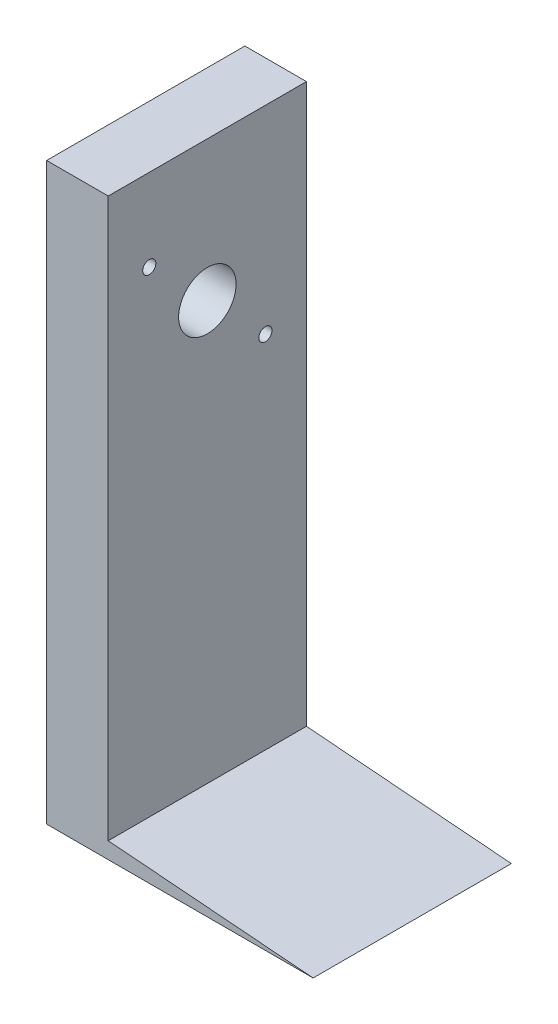
ISO-10303-21;
HEADER;
FILE_DESCRIPTION(('STEP AP214'),'2;1');
FILE_NAME('part.step','',(''),(''),'','','');
FILE_SCHEMA(('AUTOMOTIVE_DESIGN { 1 0 10303 214 1 1 1 1 }'));
ENDSEC;
DATA;
#1=APPLICATION_CONTEXT('core data for automotive mechanical design processes');
#2=APPLICATION_PROTOCOL_DEFINITION('international standard','automotive_design',2000,#1);
#3=PRODUCT_CONTEXT('',#1,'mechanical');
#4=PRODUCT('Part','Part','',(#3));
#5=PRODUCT_RELATED_PRODUCT_CATEGORY('part','',(#4));
#6=PRODUCT_DEFINITION_FORMATION('','',#4);
#7=PRODUCT_DEFINITION_CONTEXT('part definition',#1,'design');
#8=PRODUCT_DEFINITION('design','',#6,#7);
#9=PRODUCT_DEFINITION_SHAPE('','',#8);
#10=(LENGTH_UNIT() NAMED_UNIT(*) SI_UNIT(.MILLI.,.METRE.));
#11=(NAMED_UNIT(*) PLANE_ANGLE_UNIT() SI_UNIT($,.RADIAN.));
#12=(NAMED_UNIT(*) SI_UNIT($,.STERADIAN.) SOLID_ANGLE_UNIT());
#13=UNCERTAINTY_MEASURE_WITH_UNIT(LENGTH_MEASURE(1.E-05),#10,'distance_accuracy_value','');
#14=(GEOMETRIC_REPRESENTATION_CONTEXT(3) GLOBAL_UNCERTAINTY_ASSIGNED_CONTEXT((#13)) GLOBAL_UNIT_ASSIGNED_CONTEXT((#10,
#11,#12)) REPRESENTATION_CONTEXT('',''));
#15=CARTESIAN_POINT('',(0.,0.,0.));
#16=DIRECTION('',(0.,0.,1.));
#17=DIRECTION('',(1.,0.,0.));
#18=AXIS2_PLACEMENT_3D('',#15,#16,#17);
#19=CARTESIAN_POINT('',(19.05,0.,0.));
#20=DIRECTION('',(-1.,0.,0.));
#21=DIRECTION('',(0.,0.,1.));
#22=AXIS2_PLACEMENT_3D('',#19,#20,#21);
#23=PLANE('',#22);
#24=CARTESIAN_POINT('',(19.05,27.5789755157233,-17.9605122421383));
#25=DIRECTION('',(1.,0.,0.));
#26=DIRECTION('',(0.,0.,-1.));
#27=AXIS2_PLACEMENT_3D('',#24,#25,#26);
#28=CIRCLE('',#27,2.032);
#29=CARTESIAN_POINT('',(19.05,27.5789755157233,-19.9925122421383));
#30=VERTEX_POINT('',#29);
#31=EDGE_CURVE('E126',#30,#30,#28,.T.);
#32=ORIENTED_EDGE('',*,*,#31,.F.);
#33=EDGE_LOOP('',(#32));
#34=FACE_BOUND('',#33,.T.);
#35=CARTESIAN_POINT('',(19.05,63.5,17.9605122421383));
#36=DIRECTION('',(1.,0.,0.));
#37=DIRECTION('',(0.,0.,-1.));
#38=AXIS2_PLACEMENT_3D('',#35,#36,#37);
#39=CIRCLE('',#38,2.03200000000001);
#40=CARTESIAN_POINT('',(19.05,63.5,15.9285122421383));
#41=VERTEX_POINT('',#40);
#42=EDGE_CURVE('E136',#41,#41,#39,.T.);
#43=ORIENTED_EDGE('',*,*,#42,.F.);
#44=EDGE_LOOP('',(#43));
#45=FACE_BOUND('',#44,.T.);
#46=CARTESIAN_POINT('',(19.05,45.5394877578617,0.));
#47=DIRECTION('',(1.,0.,0.));
#48=DIRECTION('',(0.,0.,-1.));
#49=AXIS2_PLACEMENT_3D('',#46,#47,#48);
#50=CIRCLE('',#49,8.89);
#51=CARTESIAN_POINT('',(19.05,45.5394877578617,-8.89));
#52=VERTEX_POINT('',#51);
#53=EDGE_CURVE('E100',#52,#52,#50,.T.);
#54=ORIENTED_EDGE('',*,*,#53,.F.);
#55=EDGE_LOOP('',(#54));
#56=FACE_BOUND('',#55,.T.);
#57=DIRECTION('',(0.,0.,1.));
#58=VECTOR('',#57,1.);
#59=CARTESIAN_POINT('',(19.05,-83.82,-94.249173978566));
#60=LINE('',#59,#58);
#61=CARTESIAN_POINT('',(19.05,-83.82,-30.6605122421383));
#62=VERTEX_POINT('',#61);
#63=CARTESIAN_POINT('',(19.05,-83.82,30.6605122421383));
#64=VERTEX_POINT('',#63);
#65=EDGE_CURVE('E48',#62,#64,#60,.T.);
#66=ORIENTED_EDGE('',*,*,#65,.F.);
#67=DIRECTION('',(0.,1.,0.));
#68=VECTOR('',#67,1.);
#69=CARTESIAN_POINT('',(19.05,-88.9,-30.6605122421383));
#70=LINE('',#69,#68);
#71=CARTESIAN_POINT('',(19.05,88.9,-30.6605122421383));
#72=VERTEX_POINT('',#71);
#73=EDGE_CURVE('E85',#62,#72,#70,.T.);
#74=ORIENTED_EDGE('',*,*,#73,.T.);
#75=DIRECTION('',(0.,0.,1.));
#76=VECTOR('',#75,1.);
#77=CARTESIAN_POINT('',(19.05,88.9,30.6605122421383));
#78=LINE('',#77,#76);
#79=CARTESIAN_POINT('',(19.05,88.9,30.6605122421383));
#80=VERTEX_POINT('',#79);
#81=EDGE_CURVE('E54',#72,#80,#78,.T.);
#82=ORIENTED_EDGE('',*,*,#81,.T.);
#83=DIRECTION('',(0.,-1.,0.));
#84=VECTOR('',#83,1.);
#85=CARTESIAN_POINT('',(19.05,-88.9,30.6605122421383));
#86=LINE('',#85,#84);
#87=EDGE_CURVE('E95',#80,#64,#86,.T.);
#88=ORIENTED_EDGE('',*,*,#87,.T.);
#89=EDGE_LOOP('',(#66,#74,#82,#88));
#90=FACE_BOUND('',#89,.T.);
#91=ADVANCED_FACE('F33',(#34,#45,#56,#90),#23,.F.);
#92=CARTESIAN_POINT('',(0.,0.,0.));
#93=DIRECTION('',(-1.,0.,0.));
#94=DIRECTION('',(0.,0.,1.));
#95=AXIS2_PLACEMENT_3D('',#92,#93,#94);
#96=PLANE('',#95);
#97=CARTESIAN_POINT('',(0.,63.5,17.9605122421383));
#98=DIRECTION('',(1.,0.,0.));
#99=DIRECTION('',(0.,0.,-1.));
#100=AXIS2_PLACEMENT_3D('',#97,#98,#99);
#101=CIRCLE('',#100,2.03200000000001);
#102=CARTESIAN_POINT('',(0.,63.5,15.9285122421383));
#103=VERTEX_POINT('',#102);
#104=EDGE_CURVE('E134',#103,#103,#101,.T.);
#105=ORIENTED_EDGE('',*,*,#104,.T.);
#106=EDGE_LOOP('',(#105));
#107=FACE_BOUND('',#106,.T.);
#108=DIRECTION('',(0.,1.,0.));
#109=VECTOR('',#108,1.);
#110=CARTESIAN_POINT('',(0.,-88.9,-30.6605122421383));
#111=LINE('',#110,#109);
#112=CARTESIAN_POINT('',(0.,-88.9,-30.6605122421383));
#113=VERTEX_POINT('',#112);
#114=CARTESIAN_POINT('',(0.,88.9,-30.6605122421383));
#115=VERTEX_POINT('',#114);
#116=EDGE_CURVE('E91',#113,#115,#111,.T.);
#117=ORIENTED_EDGE('',*,*,#116,.F.);
#118=DIRECTION('',(0.,0.,-1.));
#119=VECTOR('',#118,1.);
#120=CARTESIAN_POINT('',(0.,-88.9,30.6605122421383));
#121=LINE('',#120,#119);
#122=CARTESIAN_POINT('',(0.,-88.9,30.6605122421383));
#123=VERTEX_POINT('',#122);
#124=EDGE_CURVE('E74',#123,#113,#121,.T.);
#125=ORIENTED_EDGE('',*,*,#124,.F.);
#126=DIRECTION('',(0.,-1.,0.));
#127=VECTOR('',#126,1.);
#128=CARTESIAN_POINT('',(0.,-88.9,30.6605122421383));
#129=LINE('',#128,#127);
#130=CARTESIAN_POINT('',(0.,88.9,30.6605122421383));
#131=VERTEX_POINT('',#130);
#132=EDGE_CURVE('E86',#131,#123,#129,.T.);
#133=ORIENTED_EDGE('',*,*,#132,.F.);
#134=DIRECTION('',(0.,0.,1.));
#135=VECTOR('',#134,1.);
#136=CARTESIAN_POINT('',(0.,88.9,30.6605122421383));
#137=LINE('',#136,#135);
#138=EDGE_CURVE('E99',#115,#131,#137,.T.);
#139=ORIENTED_EDGE('',*,*,#138,.F.);
#140=EDGE_LOOP('',(#117,#125,#133,#139));
#141=FACE_BOUND('',#140,.T.);
#142=CARTESIAN_POINT('',(0.,45.5394877578617,0.));
#143=DIRECTION('',(1.,0.,0.));
#144=DIRECTION('',(0.,0.,-1.));
#145=AXIS2_PLACEMENT_3D('',#142,#143,#144);
#146=CIRCLE('',#145,8.89);
#147=CARTESIAN_POINT('',(0.,45.5394877578617,-8.89));
#148=VERTEX_POINT('',#147);
#149=EDGE_CURVE('E104',#148,#148,#146,.T.);
#150=ORIENTED_EDGE('',*,*,#149,.T.);
#151=EDGE_LOOP('',(#150));
#152=FACE_BOUND('',#151,.T.);
#153=CARTESIAN_POINT('',(0.,27.5789755157233,-17.9605122421383));
#154=DIRECTION('',(1.,0.,0.));
#155=DIRECTION('',(0.,0.,-1.));
#156=AXIS2_PLACEMENT_3D('',#153,#154,#155);
#157=CIRCLE('',#156,2.032);
#158=CARTESIAN_POINT('',(0.,27.5789755157233,-19.9925122421383));
#159=VERTEX_POINT('',#158);
#160=EDGE_CURVE('E123',#159,#159,#157,.T.);
#161=ORIENTED_EDGE('',*,*,#160,.T.);
#162=EDGE_LOOP('',(#161));
#163=FACE_BOUND('',#162,.T.);
#164=ADVANCED_FACE('F97',(#107,#141,#152,#163),#96,.T.);
#165=CARTESIAN_POINT('',(19.05,-88.9,-30.6605122421383));
#166=DIRECTION('',(0.,0.,1.));
#167=DIRECTION('',(1.,0.,0.));
#168=AXIS2_PLACEMENT_3D('',#165,#166,#167);
#169=PLANE('',#168);
#170=ORIENTED_EDGE('',*,*,#116,.T.);
#171=DIRECTION('',(-1.,0.,0.));
#172=VECTOR('',#171,1.);
#173=CARTESIAN_POINT('',(19.05,88.9,-30.6605122421383));
#174=LINE('',#173,#172);
#175=EDGE_CURVE('E11',#72,#115,#174,.T.);
#176=ORIENTED_EDGE('',*,*,#175,.F.);
#177=ORIENTED_EDGE('',*,*,#73,.F.);
#178=DIRECTION('',(0.996803809488646,-0.0798884559177607,0.));
#179=VECTOR('',#178,1.);
#180=CARTESIAN_POINT('',(82.435420259156,-88.9,-30.6605122421383));
#181=LINE('',#180,#179);
#182=CARTESIAN_POINT('',(82.435420259156,-88.9,-30.6605122421383));
#183=VERTEX_POINT('',#182);
#184=EDGE_CURVE('E93',#62,#183,#181,.T.);
#185=ORIENTED_EDGE('',*,*,#184,.T.);
#186=DIRECTION('',(-1.,0.,0.));
#187=VECTOR('',#186,1.);
#188=CARTESIAN_POINT('',(19.05,-88.9,-30.6605122421383));
#189=LINE('',#188,#187);
#190=EDGE_CURVE('E78',#183,#113,#189,.T.);
#191=ORIENTED_EDGE('',*,*,#190,.T.);
#192=EDGE_LOOP('',(#170,#176,#177,#185,#191));
#193=FACE_BOUND('',#192,.T.);
#194=ADVANCED_FACE('F35',(#193),#169,.F.);
#195=CARTESIAN_POINT('',(19.05,88.9,30.6605122421383));
#196=DIRECTION('',(0.,-1.,0.));
#197=DIRECTION('',(0.,0.,-1.));
#198=AXIS2_PLACEMENT_3D('',#195,#196,#197);
#199=PLANE('',#198);
#200=ORIENTED_EDGE('',*,*,#138,.T.);
#201=DIRECTION('',(-1.,0.,0.));
#202=VECTOR('',#201,1.);
#203=CARTESIAN_POINT('',(19.05,88.9,30.6605122421383));
#204=LINE('',#203,#202);
#205=EDGE_CURVE('E41',#80,#131,#204,.T.);
#206=ORIENTED_EDGE('',*,*,#205,.F.);
#207=ORIENTED_EDGE('',*,*,#81,.F.);
#208=ORIENTED_EDGE('',*,*,#175,.T.);
#209=EDGE_LOOP('',(#200,#206,#207,#208));
#210=FACE_BOUND('',#209,.T.);
#211=ADVANCED_FACE('F116',(#210),#199,.F.);
#212=CARTESIAN_POINT('',(19.05,-88.9,30.6605122421383));
#213=DIRECTION('',(0.,0.,-1.));
#214=DIRECTION('',(-1.,0.,0.));
#215=AXIS2_PLACEMENT_3D('',#212,#213,#214);
#216=PLANE('',#215);
#217=ORIENTED_EDGE('',*,*,#132,.T.);
#218=DIRECTION('',(-1.,0.,0.));
#219=VECTOR('',#218,1.);
#220=CARTESIAN_POINT('',(19.05,-88.9,30.6605122421383));
#221=LINE('',#220,#219);
#222=CARTESIAN_POINT('',(82.435420259156,-88.9,30.6605122421383));
#223=VERTEX_POINT('',#222);
#224=EDGE_CURVE('E81',#223,#123,#221,.T.);
#225=ORIENTED_EDGE('',*,*,#224,.F.);
#226=DIRECTION('',(-0.996803809488646,0.0798884559177607,0.));
#227=VECTOR('',#226,1.);
#228=CARTESIAN_POINT('',(82.435420259156,-88.9,30.6605122421383));
#229=LINE('',#228,#227);
#230=EDGE_CURVE('E130',#223,#64,#229,.T.);
#231=ORIENTED_EDGE('',*,*,#230,.T.);
#232=ORIENTED_EDGE('',*,*,#87,.F.);
#233=ORIENTED_EDGE('',*,*,#205,.T.);
#234=EDGE_LOOP('',(#217,#225,#231,#232,#233));
#235=FACE_BOUND('',#234,.T.);
#236=ADVANCED_FACE('F113',(#235),#216,.F.);
#237=CARTESIAN_POINT('',(19.05,-88.9,30.6605122421383));
#238=DIRECTION('',(0.,1.,0.));
#239=DIRECTION('',(0.,0.,1.));
#240=AXIS2_PLACEMENT_3D('',#237,#238,#239);
#241=PLANE('',#240);
#242=ORIENTED_EDGE('',*,*,#124,.T.);
#243=ORIENTED_EDGE('',*,*,#190,.F.);
#244=DIRECTION('',(0.,0.,1.));
#245=VECTOR('',#244,1.);
#246=CARTESIAN_POINT('',(82.435420259156,-88.9,-94.249173978566));
#247=LINE('',#246,#245);
#248=EDGE_CURVE('E122',#183,#223,#247,.T.);
#249=ORIENTED_EDGE('',*,*,#248,.T.);
#250=ORIENTED_EDGE('',*,*,#224,.T.);
#251=EDGE_LOOP('',(#242,#243,#249,#250));
#252=FACE_BOUND('',#251,.T.);
#253=ADVANCED_FACE('F76',(#252),#241,.F.);
#254=CARTESIAN_POINT('',(19.05,45.5394877578617,0.));
#255=DIRECTION('',(-1.,0.,0.));
#256=DIRECTION('',(0.,0.,1.));
#257=AXIS2_PLACEMENT_3D('',#254,#255,#256);
#258=CYLINDRICAL_SURFACE('',#257,8.89);
#259=ORIENTED_EDGE('',*,*,#53,.T.);
#260=EDGE_LOOP('',(#259));
#261=FACE_BOUND('',#260,.T.);
#262=ORIENTED_EDGE('',*,*,#149,.F.);
#263=EDGE_LOOP('',(#262));
#264=FACE_BOUND('',#263,.T.);
#265=ADVANCED_FACE('F156',(#261,#264),#258,.F.);
#266=CARTESIAN_POINT('',(19.05,63.5,17.9605122421383));
#267=DIRECTION('',(-1.,0.,0.));
#268=DIRECTION('',(0.,0.,1.));
#269=AXIS2_PLACEMENT_3D('',#266,#267,#268);
#270=CYLINDRICAL_SURFACE('',#269,2.03200000000001);
#271=ORIENTED_EDGE('',*,*,#42,.T.);
#272=EDGE_LOOP('',(#271));
#273=FACE_BOUND('',#272,.T.);
#274=ORIENTED_EDGE('',*,*,#104,.F.);
#275=EDGE_LOOP('',(#274));
#276=FACE_BOUND('',#275,.T.);
#277=ADVANCED_FACE('F188',(#273,#276),#270,.F.);
#278=CARTESIAN_POINT('',(19.05,27.5789755157233,-17.9605122421383));
#279=DIRECTION('',(-1.,0.,0.));
#280=DIRECTION('',(0.,0.,1.));
#281=AXIS2_PLACEMENT_3D('',#278,#279,#280);
#282=CYLINDRICAL_SURFACE('',#281,2.032);
#283=ORIENTED_EDGE('',*,*,#31,.T.);
#284=EDGE_LOOP('',(#283));
#285=FACE_BOUND('',#284,.T.);
#286=ORIENTED_EDGE('',*,*,#160,.F.);
#287=EDGE_LOOP('',(#286));
#288=FACE_BOUND('',#287,.T.);
#289=ADVANCED_FACE('F198',(#285,#288),#282,.F.);
#290=CARTESIAN_POINT('',(82.435420259156,-88.9,-94.249173978566));
#291=DIRECTION('',(0.0798884559177607,0.996803809488646,0.));
#292=DIRECTION('',(-0.996803809488646,0.0798884559177607,0.));
#293=AXIS2_PLACEMENT_3D('',#290,#291,#292);
#294=PLANE('',#293);
#295=ORIENTED_EDGE('',*,*,#184,.F.);
#296=ORIENTED_EDGE('',*,*,#65,.T.);
#297=ORIENTED_EDGE('',*,*,#230,.F.);
#298=ORIENTED_EDGE('',*,*,#248,.F.);
#299=EDGE_LOOP('',(#295,#296,#297,#298));
#300=FACE_BOUND('',#299,.T.);
#301=ADVANCED_FACE('F119',(#300),#294,.T.);
#302=CLOSED_SHELL('',(#91,#164,#194,#211,#236,#253,#265,#277,#289,#301));
#303=MANIFOLD_SOLID_BREP('B2',#302);
#304=ADVANCED_BREP_SHAPE_REPRESENTATION('',(#18,#303),#14);
#305=SHAPE_DEFINITION_REPRESENTATION(#9,#304);
ENDSEC;
END-ISO-10303-21;
